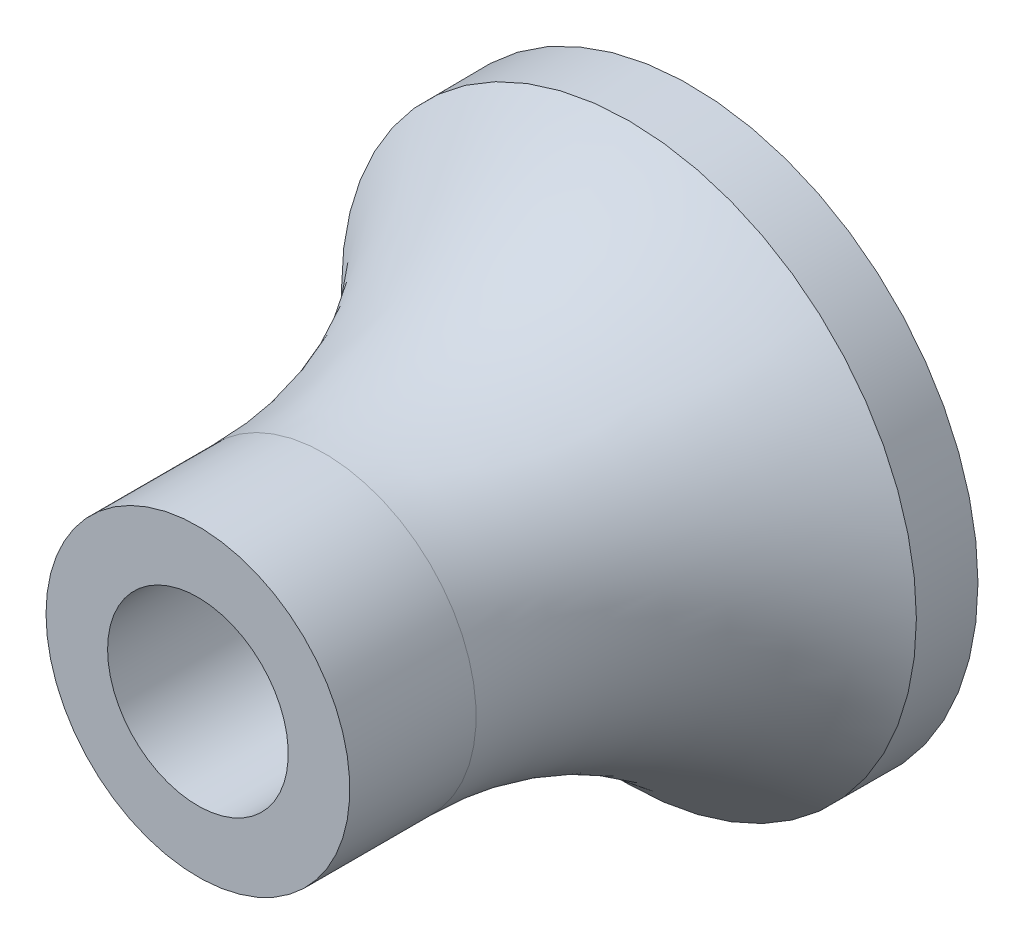
ISO-10303-21;
HEADER;
FILE_DESCRIPTION(('STEP AP214'),'2;1');
FILE_NAME('part.step','',(''),(''),'','','');
FILE_SCHEMA(('AUTOMOTIVE_DESIGN { 1 0 10303 214 1 1 1 1 }'));
ENDSEC;
DATA;
#1=APPLICATION_CONTEXT('core data for automotive mechanical design processes');
#2=APPLICATION_PROTOCOL_DEFINITION('international standard','automotive_design',2000,#1);
#3=PRODUCT_CONTEXT('',#1,'mechanical');
#4=PRODUCT('Part','Part','',(#3));
#5=PRODUCT_RELATED_PRODUCT_CATEGORY('part','',(#4));
#6=PRODUCT_DEFINITION_FORMATION('','',#4);
#7=PRODUCT_DEFINITION_CONTEXT('part definition',#1,'design');
#8=PRODUCT_DEFINITION('design','',#6,#7);
#9=PRODUCT_DEFINITION_SHAPE('','',#8);
#10=(LENGTH_UNIT() NAMED_UNIT(*) SI_UNIT(.MILLI.,.METRE.));
#11=(NAMED_UNIT(*) PLANE_ANGLE_UNIT() SI_UNIT($,.RADIAN.));
#12=(NAMED_UNIT(*) SI_UNIT($,.STERADIAN.) SOLID_ANGLE_UNIT());
#13=UNCERTAINTY_MEASURE_WITH_UNIT(LENGTH_MEASURE(1.E-05),#10,'distance_accuracy_value','');
#14=(GEOMETRIC_REPRESENTATION_CONTEXT(3) GLOBAL_UNCERTAINTY_ASSIGNED_CONTEXT((#13)) GLOBAL_UNIT_ASSIGNED_CONTEXT((#10,
#11,#12)) REPRESENTATION_CONTEXT('',''));
#15=CARTESIAN_POINT('',(0.,0.,0.));
#16=DIRECTION('',(0.,0.,1.));
#17=DIRECTION('',(1.,0.,0.));
#18=AXIS2_PLACEMENT_3D('',#15,#16,#17);
#19=CARTESIAN_POINT('',(0.,0.,-10.));
#20=DIRECTION('',(0.,0.,-1.));
#21=DIRECTION('',(-1.,0.,0.));
#22=AXIS2_PLACEMENT_3D('',#19,#20,#21);
#23=PLANE('',#22);
#24=CARTESIAN_POINT('',(0.,0.,-10.));
#25=DIRECTION('',(0.,0.,-1.));
#26=DIRECTION('',(-1.,0.,0.));
#27=AXIS2_PLACEMENT_3D('',#24,#25,#26);
#28=CIRCLE('',#27,3.7);
#29=CARTESIAN_POINT('',(-3.7,0.,-10.));
#30=VERTEX_POINT('',#29);
#31=EDGE_CURVE('E37',#30,#30,#28,.T.);
#32=ORIENTED_EDGE('',*,*,#31,.F.);
#33=EDGE_LOOP('',(#32));
#34=FACE_BOUND('',#33,.T.);
#35=CARTESIAN_POINT('',(0.,0.,-10.));
#36=DIRECTION('',(0.,0.,-1.));
#37=DIRECTION('',(-1.,0.,0.));
#38=AXIS2_PLACEMENT_3D('',#35,#36,#37);
#39=CIRCLE('',#38,2.2);
#40=CARTESIAN_POINT('',(-2.2,0.,-10.));
#41=VERTEX_POINT('',#40);
#42=EDGE_CURVE('E41',#41,#41,#39,.T.);
#43=ORIENTED_EDGE('',*,*,#42,.T.);
#44=EDGE_LOOP('',(#43));
#45=FACE_BOUND('',#44,.T.);
#46=ADVANCED_FACE('F30',(#34,#45),#23,.F.);
#47=CARTESIAN_POINT('',(0.,0.,-22.));
#48=DIRECTION('',(0.,0.,1.));
#49=DIRECTION('',(1.,0.,0.));
#50=AXIS2_PLACEMENT_3D('',#47,#48,#49);
#51=CYLINDRICAL_SURFACE('',#50,3.7);
#52=CARTESIAN_POINT('',(0.,0.,-13.076389018813));
#53=DIRECTION('',(0.,0.,-1.));
#54=DIRECTION('',(-1.,0.,0.));
#55=AXIS2_PLACEMENT_3D('',#52,#53,#54);
#56=CIRCLE('',#55,3.7);
#57=CARTESIAN_POINT('',(-3.7,0.,-13.076389018813));
#58=VERTEX_POINT('',#57);
#59=EDGE_CURVE('E10',#58,#58,#56,.F.);
#60=ORIENTED_EDGE('',*,*,#59,.T.);
#61=EDGE_LOOP('',(#60));
#62=FACE_BOUND('',#61,.T.);
#63=ORIENTED_EDGE('',*,*,#31,.T.);
#64=EDGE_LOOP('',(#63));
#65=FACE_BOUND('',#64,.T.);
#66=ADVANCED_FACE('F84',(#62,#65),#51,.T.);
#67=CARTESIAN_POINT('',(0.,0.,-22.));
#68=DIRECTION('',(0.,0.,1.));
#69=DIRECTION('',(1.,0.,0.));
#70=AXIS2_PLACEMENT_3D('',#67,#68,#69);
#71=CYLINDRICAL_SURFACE('',#70,2.2);
#72=ORIENTED_EDGE('',*,*,#42,.F.);
#73=EDGE_LOOP('',(#72));
#74=FACE_BOUND('',#73,.T.);
#75=CARTESIAN_POINT('',(0.,0.,-23.));
#76=DIRECTION('',(0.,0.,-1.));
#77=DIRECTION('',(-1.,0.,0.));
#78=AXIS2_PLACEMENT_3D('',#75,#76,#77);
#79=CIRCLE('',#78,2.2);
#80=CARTESIAN_POINT('',(-2.2,0.,-23.));
#81=VERTEX_POINT('',#80);
#82=EDGE_CURVE('E50',#81,#81,#79,.T.);
#83=ORIENTED_EDGE('',*,*,#82,.T.);
#84=EDGE_LOOP('',(#83));
#85=FACE_BOUND('',#84,.T.);
#86=ADVANCED_FACE('F91',(#74,#85),#71,.F.);
#87=CARTESIAN_POINT('',(0.,0.,-23.));
#88=DIRECTION('',(0.,0.,-1.));
#89=DIRECTION('',(-1.,0.,0.));
#90=AXIS2_PLACEMENT_3D('',#87,#88,#89);
#91=PLANE('',#90);
#92=CARTESIAN_POINT('',(0.,0.,-23.));
#93=DIRECTION('',(0.,0.,-1.));
#94=DIRECTION('',(-1.,0.,0.));
#95=AXIS2_PLACEMENT_3D('',#92,#93,#94);
#96=CIRCLE('',#95,4.8);
#97=CARTESIAN_POINT('',(-4.8,0.,-23.));
#98=VERTEX_POINT('',#97);
#99=EDGE_CURVE('E45',#98,#98,#96,.T.);
#100=ORIENTED_EDGE('',*,*,#99,.T.);
#101=EDGE_LOOP('',(#100));
#102=FACE_BOUND('',#101,.T.);
#103=ORIENTED_EDGE('',*,*,#82,.F.);
#104=EDGE_LOOP('',(#103));
#105=FACE_BOUND('',#104,.T.);
#106=ADVANCED_FACE('F80',(#102,#105),#91,.T.);
#107=CARTESIAN_POINT('',(0.,0.,-23.));
#108=DIRECTION('',(0.,0.,1.));
#109=DIRECTION('',(1.,0.,0.));
#110=AXIS2_PLACEMENT_3D('',#107,#108,#109);
#111=CYLINDRICAL_SURFACE('',#110,4.8);
#112=ORIENTED_EDGE('',*,*,#99,.F.);
#113=EDGE_LOOP('',(#112));
#114=FACE_BOUND('',#113,.T.);
#115=CARTESIAN_POINT('',(0.,0.,-22.));
#116=DIRECTION('',(0.,0.,1.));
#117=DIRECTION('',(1.,0.,0.));
#118=AXIS2_PLACEMENT_3D('',#115,#116,#117);
#119=CIRCLE('',#118,4.8);
#120=CARTESIAN_POINT('',(4.8,0.,-22.));
#121=VERTEX_POINT('',#120);
#122=EDGE_CURVE('E53',#121,#121,#119,.T.);
#123=ORIENTED_EDGE('',*,*,#122,.F.);
#124=EDGE_LOOP('',(#123));
#125=FACE_BOUND('',#124,.T.);
#126=ADVANCED_FACE('F73',(#114,#125),#111,.T.);
#127=CARTESIAN_POINT('',(0.,0.,-22.));
#128=DIRECTION('',(0.,0.,1.));
#129=DIRECTION('',(1.,0.,0.));
#130=AXIS2_PLACEMENT_3D('',#127,#128,#129);
#131=PLANE('',#130);
#132=ORIENTED_EDGE('',*,*,#122,.T.);
#133=EDGE_LOOP('',(#132));
#134=FACE_BOUND('',#133,.T.);
#135=CARTESIAN_POINT('',(0.,0.,-22.));
#136=DIRECTION('',(0.,0.,1.));
#137=DIRECTION('',(1.,0.,0.));
#138=AXIS2_PLACEMENT_3D('',#135,#136,#137);
#139=CIRCLE('',#138,7.);
#140=CARTESIAN_POINT('',(7.,0.,-22.));
#141=VERTEX_POINT('',#140);
#142=EDGE_CURVE('E57',#141,#141,#139,.T.);
#143=ORIENTED_EDGE('',*,*,#142,.F.);
#144=EDGE_LOOP('',(#143));
#145=FACE_BOUND('',#144,.T.);
#146=ADVANCED_FACE('F68',(#134,#145),#131,.F.);
#147=CARTESIAN_POINT('',(0.,0.,-20.5));
#148=DIRECTION('',(0.,0.,-1.));
#149=DIRECTION('',(-1.,0.,0.));
#150=AXIS2_PLACEMENT_3D('',#147,#148,#149);
#151=CYLINDRICAL_SURFACE('',#150,7.);
#152=CARTESIAN_POINT('',(0.,0.,-20.5));
#153=DIRECTION('',(0.,0.,1.));
#154=DIRECTION('',(1.,0.,0.));
#155=AXIS2_PLACEMENT_3D('',#152,#153,#154);
#156=CIRCLE('',#155,7.);
#157=CARTESIAN_POINT('',(7.,0.,-20.5));
#158=VERTEX_POINT('',#157);
#159=EDGE_CURVE('E56',#158,#158,#156,.T.);
#160=ORIENTED_EDGE('',*,*,#159,.F.);
#161=EDGE_LOOP('',(#160));
#162=FACE_BOUND('',#161,.T.);
#163=ORIENTED_EDGE('',*,*,#142,.T.);
#164=EDGE_LOOP('',(#163));
#165=FACE_BOUND('',#164,.T.);
#166=ADVANCED_FACE('F65',(#162,#165),#151,.T.);
#167=CARTESIAN_POINT('',(0.,0.,-13.076389018813));
#168=DIRECTION('',(0.,0.,-1.));
#169=DIRECTION('',(-1.,0.,0.));
#170=AXIS2_PLACEMENT_3D('',#167,#168,#169);
#171=TOROIDAL_SURFACE('',#170,13.7,10.);
#172=ORIENTED_EDGE('',*,*,#159,.T.);
#173=EDGE_LOOP('',(#172));
#174=FACE_BOUND('',#173,.T.);
#175=ORIENTED_EDGE('',*,*,#59,.F.);
#176=EDGE_LOOP('',(#175));
#177=FACE_BOUND('',#176,.T.);
#178=ADVANCED_FACE('F32',(#174,#177),#171,.F.);
#179=CLOSED_SHELL('',(#46,#66,#86,#106,#126,#146,#166,#178));
#180=MANIFOLD_SOLID_BREP('B2',#179);
#181=ADVANCED_BREP_SHAPE_REPRESENTATION('',(#18,#180),#14);
#182=SHAPE_DEFINITION_REPRESENTATION(#9,#181);
ENDSEC;
END-ISO-10303-21;
